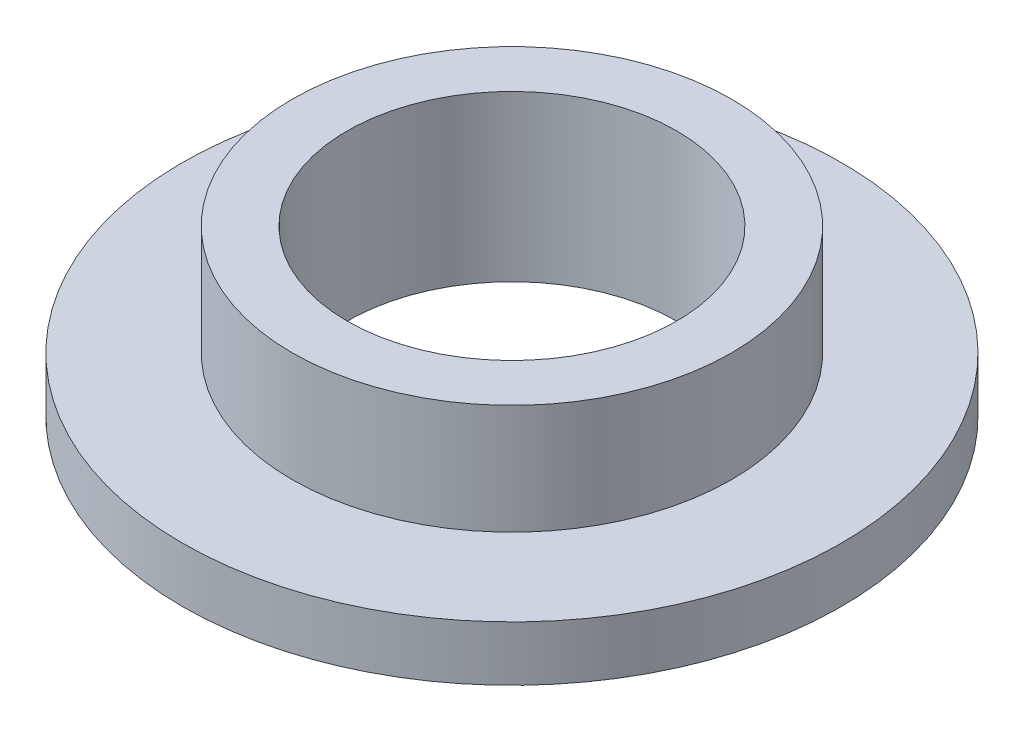
ISO-10303-21;
HEADER;
FILE_DESCRIPTION(('STEP AP214'),'2;1');
FILE_NAME('part.step','',(''),(''),'','','');
FILE_SCHEMA(('AUTOMOTIVE_DESIGN { 1 0 10303 214 1 1 1 1 }'));
ENDSEC;
DATA;
#1=APPLICATION_CONTEXT('core data for automotive mechanical design processes');
#2=APPLICATION_PROTOCOL_DEFINITION('international standard','automotive_design',2000,#1);
#3=PRODUCT_CONTEXT('',#1,'mechanical');
#4=PRODUCT('Part','Part','',(#3));
#5=PRODUCT_RELATED_PRODUCT_CATEGORY('part','',(#4));
#6=PRODUCT_DEFINITION_FORMATION('','',#4);
#7=PRODUCT_DEFINITION_CONTEXT('part definition',#1,'design');
#8=PRODUCT_DEFINITION('design','',#6,#7);
#9=PRODUCT_DEFINITION_SHAPE('','',#8);
#10=(LENGTH_UNIT() NAMED_UNIT(*) SI_UNIT(.MILLI.,.METRE.));
#11=(NAMED_UNIT(*) PLANE_ANGLE_UNIT() SI_UNIT($,.RADIAN.));
#12=(NAMED_UNIT(*) SI_UNIT($,.STERADIAN.) SOLID_ANGLE_UNIT());
#13=UNCERTAINTY_MEASURE_WITH_UNIT(LENGTH_MEASURE(1.E-05),#10,'distance_accuracy_value','');
#14=(GEOMETRIC_REPRESENTATION_CONTEXT(3) GLOBAL_UNCERTAINTY_ASSIGNED_CONTEXT((#13)) GLOBAL_UNIT_ASSIGNED_CONTEXT((#10,
#11,#12)) REPRESENTATION_CONTEXT('',''));
#15=CARTESIAN_POINT('',(0.,0.,0.));
#16=DIRECTION('',(0.,0.,1.));
#17=DIRECTION('',(1.,0.,0.));
#18=AXIS2_PLACEMENT_3D('',#15,#16,#17);
#19=CARTESIAN_POINT('',(0.,3.175,0.));
#20=DIRECTION('',(0.,-1.,0.));
#21=DIRECTION('',(0.,0.,-1.));
#22=AXIS2_PLACEMENT_3D('',#19,#20,#21);
#23=CYLINDRICAL_SURFACE('',#22,19.05);
#24=CARTESIAN_POINT('',(0.,3.175,0.));
#25=DIRECTION('',(0.,1.,0.));
#26=DIRECTION('',(0.,0.,1.));
#27=AXIS2_PLACEMENT_3D('',#24,#25,#26);
#28=CIRCLE('',#27,19.05);
#29=CARTESIAN_POINT('',(0.,3.175,19.05));
#30=VERTEX_POINT('',#29);
#31=EDGE_CURVE('E12',#30,#30,#28,.T.);
#32=ORIENTED_EDGE('',*,*,#31,.F.);
#33=EDGE_LOOP('',(#32));
#34=FACE_BOUND('',#33,.T.);
#35=CARTESIAN_POINT('',(0.,0.,0.));
#36=DIRECTION('',(0.,1.,0.));
#37=DIRECTION('',(0.,0.,1.));
#38=AXIS2_PLACEMENT_3D('',#35,#36,#37);
#39=CIRCLE('',#38,19.05);
#40=CARTESIAN_POINT('',(0.,0.,19.05));
#41=VERTEX_POINT('',#40);
#42=EDGE_CURVE('E45',#41,#41,#39,.T.);
#43=ORIENTED_EDGE('',*,*,#42,.T.);
#44=EDGE_LOOP('',(#43));
#45=FACE_BOUND('',#44,.T.);
#46=ADVANCED_FACE('F42',(#34,#45),#23,.T.);
#47=CARTESIAN_POINT('',(0.,3.175,0.));
#48=DIRECTION('',(0.,1.,0.));
#49=DIRECTION('',(0.,0.,1.));
#50=AXIS2_PLACEMENT_3D('',#47,#48,#49);
#51=PLANE('',#50);
#52=CARTESIAN_POINT('',(0.,3.175,0.));
#53=DIRECTION('',(0.,1.,0.));
#54=DIRECTION('',(0.,0.,1.));
#55=AXIS2_PLACEMENT_3D('',#52,#53,#54);
#56=CIRCLE('',#55,12.7);
#57=CARTESIAN_POINT('',(0.,3.175,12.7));
#58=VERTEX_POINT('',#57);
#59=EDGE_CURVE('E54',#58,#58,#56,.T.);
#60=ORIENTED_EDGE('',*,*,#59,.F.);
#61=EDGE_LOOP('',(#60));
#62=FACE_BOUND('',#61,.T.);
#63=ORIENTED_EDGE('',*,*,#31,.T.);
#64=EDGE_LOOP('',(#63));
#65=FACE_BOUND('',#64,.T.);
#66=ADVANCED_FACE('F87',(#62,#65),#51,.T.);
#67=CARTESIAN_POINT('',(0.,0.,0.));
#68=DIRECTION('',(0.,1.,0.));
#69=DIRECTION('',(0.,0.,1.));
#70=AXIS2_PLACEMENT_3D('',#67,#68,#69);
#71=PLANE('',#70);
#72=CARTESIAN_POINT('',(0.,0.,0.));
#73=DIRECTION('',(0.,1.,0.));
#74=DIRECTION('',(0.,0.,1.));
#75=AXIS2_PLACEMENT_3D('',#72,#73,#74);
#76=CIRCLE('',#75,9.525);
#77=CARTESIAN_POINT('',(0.,0.,9.525));
#78=VERTEX_POINT('',#77);
#79=EDGE_CURVE('E57',#78,#78,#76,.T.);
#80=ORIENTED_EDGE('',*,*,#79,.T.);
#81=EDGE_LOOP('',(#80));
#82=FACE_BOUND('',#81,.T.);
#83=ORIENTED_EDGE('',*,*,#42,.F.);
#84=EDGE_LOOP('',(#83));
#85=FACE_BOUND('',#84,.T.);
#86=ADVANCED_FACE('F66',(#82,#85),#71,.F.);
#87=CARTESIAN_POINT('',(0.,9.525,0.));
#88=DIRECTION('',(0.,-1.,0.));
#89=DIRECTION('',(0.,0.,-1.));
#90=AXIS2_PLACEMENT_3D('',#87,#88,#89);
#91=CYLINDRICAL_SURFACE('',#90,12.7);
#92=CARTESIAN_POINT('',(0.,9.525,0.));
#93=DIRECTION('',(0.,1.,0.));
#94=DIRECTION('',(0.,0.,1.));
#95=AXIS2_PLACEMENT_3D('',#92,#93,#94);
#96=CIRCLE('',#95,12.7);
#97=CARTESIAN_POINT('',(0.,9.525,12.7));
#98=VERTEX_POINT('',#97);
#99=EDGE_CURVE('E52',#98,#98,#96,.T.);
#100=ORIENTED_EDGE('',*,*,#99,.F.);
#101=EDGE_LOOP('',(#100));
#102=FACE_BOUND('',#101,.T.);
#103=ORIENTED_EDGE('',*,*,#59,.T.);
#104=EDGE_LOOP('',(#103));
#105=FACE_BOUND('',#104,.T.);
#106=ADVANCED_FACE('F78',(#102,#105),#91,.T.);
#107=CARTESIAN_POINT('',(0.,9.525,0.));
#108=DIRECTION('',(0.,1.,0.));
#109=DIRECTION('',(0.,0.,1.));
#110=AXIS2_PLACEMENT_3D('',#107,#108,#109);
#111=PLANE('',#110);
#112=CARTESIAN_POINT('',(0.,9.525,0.));
#113=DIRECTION('',(0.,1.,0.));
#114=DIRECTION('',(0.,0.,1.));
#115=AXIS2_PLACEMENT_3D('',#112,#113,#114);
#116=CIRCLE('',#115,9.525);
#117=CARTESIAN_POINT('',(0.,9.525,9.525));
#118=VERTEX_POINT('',#117);
#119=EDGE_CURVE('E60',#118,#118,#116,.T.);
#120=ORIENTED_EDGE('',*,*,#119,.F.);
#121=EDGE_LOOP('',(#120));
#122=FACE_BOUND('',#121,.T.);
#123=ORIENTED_EDGE('',*,*,#99,.T.);
#124=EDGE_LOOP('',(#123));
#125=FACE_BOUND('',#124,.T.);
#126=ADVANCED_FACE('F72',(#122,#125),#111,.T.);
#127=CARTESIAN_POINT('',(0.,0.,0.));
#128=DIRECTION('',(0.,1.,0.));
#129=DIRECTION('',(0.,0.,1.));
#130=AXIS2_PLACEMENT_3D('',#127,#128,#129);
#131=CYLINDRICAL_SURFACE('',#130,9.525);
#132=ORIENTED_EDGE('',*,*,#79,.F.);
#133=EDGE_LOOP('',(#132));
#134=FACE_BOUND('',#133,.T.);
#135=ORIENTED_EDGE('',*,*,#119,.T.);
#136=EDGE_LOOP('',(#135));
#137=FACE_BOUND('',#136,.T.);
#138=ADVANCED_FACE('F69',(#134,#137),#131,.F.);
#139=CLOSED_SHELL('',(#46,#66,#86,#106,#126,#138));
#140=MANIFOLD_SOLID_BREP('B2',#139);
#141=ADVANCED_BREP_SHAPE_REPRESENTATION('',(#18,#140),#14);
#142=SHAPE_DEFINITION_REPRESENTATION(#9,#141);
ENDSEC;
END-ISO-10303-21;
